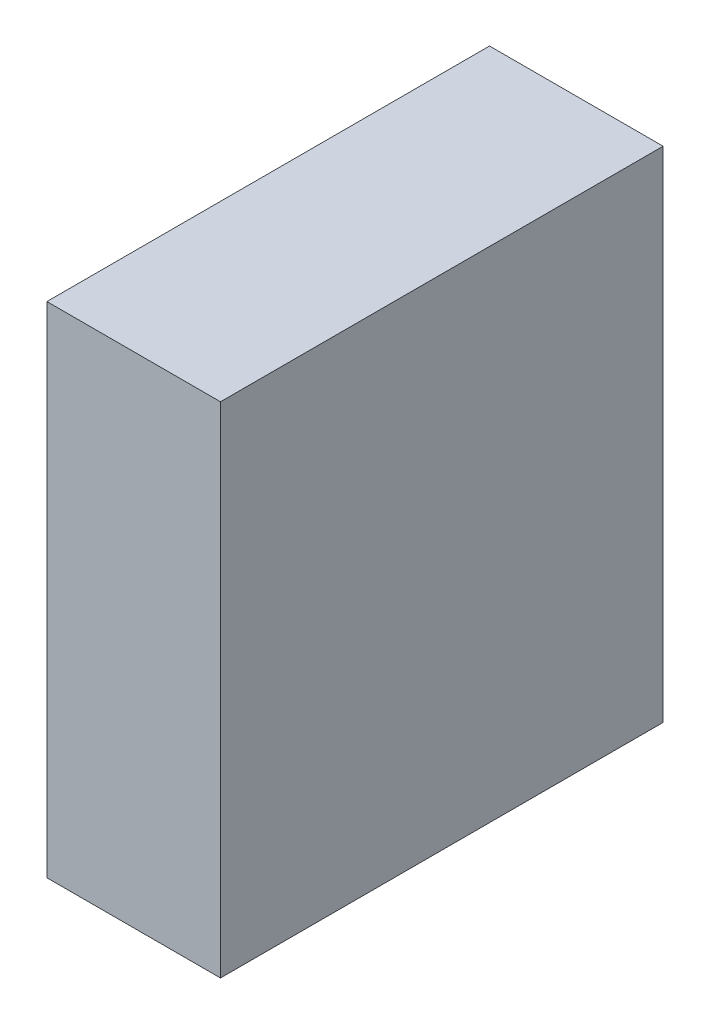
ISO-10303-21;
HEADER;
FILE_DESCRIPTION(('STEP AP214'),'2;1');
FILE_NAME('part.step','',(''),(''),'','','');
FILE_SCHEMA(('AUTOMOTIVE_DESIGN { 1 0 10303 214 1 1 1 1 }'));
ENDSEC;
DATA;
#1=APPLICATION_CONTEXT('core data for automotive mechanical design processes');
#2=APPLICATION_PROTOCOL_DEFINITION('international standard','automotive_design',2000,#1);
#3=PRODUCT_CONTEXT('',#1,'mechanical');
#4=PRODUCT('Part','Part','',(#3));
#5=PRODUCT_RELATED_PRODUCT_CATEGORY('part','',(#4));
#6=PRODUCT_DEFINITION_FORMATION('','',#4);
#7=PRODUCT_DEFINITION_CONTEXT('part definition',#1,'design');
#8=PRODUCT_DEFINITION('design','',#6,#7);
#9=PRODUCT_DEFINITION_SHAPE('','',#8);
#10=(LENGTH_UNIT() NAMED_UNIT(*) SI_UNIT(.MILLI.,.METRE.));
#11=(NAMED_UNIT(*) PLANE_ANGLE_UNIT() SI_UNIT($,.RADIAN.));
#12=(NAMED_UNIT(*) SI_UNIT($,.STERADIAN.) SOLID_ANGLE_UNIT());
#13=UNCERTAINTY_MEASURE_WITH_UNIT(LENGTH_MEASURE(1.E-05),#10,'distance_accuracy_value','');
#14=(GEOMETRIC_REPRESENTATION_CONTEXT(3) GLOBAL_UNCERTAINTY_ASSIGNED_CONTEXT((#13)) GLOBAL_UNIT_ASSIGNED_CONTEXT((#10,
#11,#12)) REPRESENTATION_CONTEXT('',''));
#15=CARTESIAN_POINT('',(0.,0.,0.));
#16=DIRECTION('',(0.,0.,1.));
#17=DIRECTION('',(1.,0.,0.));
#18=AXIS2_PLACEMENT_3D('',#15,#16,#17);
#19=CARTESIAN_POINT('',(0.0999998,0.28750006,0.));
#20=DIRECTION('',(1.,0.,0.));
#21=DIRECTION('',(0.,0.,-1.));
#22=AXIS2_PLACEMENT_3D('',#19,#20,#21);
#23=PLANE('',#22);
#24=DIRECTION('',(0.,0.,-1.));
#25=VECTOR('',#24,1.);
#26=CARTESIAN_POINT('',(0.0999998,-0.2875026,0.));
#27=LINE('',#26,#25);
#28=CARTESIAN_POINT('',(0.0999998,-0.2875026,0.));
#29=VERTEX_POINT('',#28);
#30=CARTESIAN_POINT('',(0.0999998,-0.2875026,0.50999898));
#31=VERTEX_POINT('',#30);
#32=EDGE_CURVE('E20',#29,#31,#27,.F.);
#33=ORIENTED_EDGE('',*,*,#32,.F.);
#34=DIRECTION('',(0.,1.,0.));
#35=VECTOR('',#34,1.);
#36=CARTESIAN_POINT('',(0.0999998,-0.2875026,0.));
#37=LINE('',#36,#35);
#38=CARTESIAN_POINT('',(0.0999998,0.28750006,0.));
#39=VERTEX_POINT('',#38);
#40=EDGE_CURVE('E80',#29,#39,#37,.T.);
#41=ORIENTED_EDGE('',*,*,#40,.T.);
#42=DIRECTION('',(0.,0.,1.));
#43=VECTOR('',#42,1.);
#44=CARTESIAN_POINT('',(0.0999998,0.28750006,0.));
#45=LINE('',#44,#43);
#46=CARTESIAN_POINT('',(0.0999998,0.28750006,0.50999898));
#47=VERTEX_POINT('',#46);
#48=EDGE_CURVE('E68',#47,#39,#45,.F.);
#49=ORIENTED_EDGE('',*,*,#48,.F.);
#50=DIRECTION('',(0.,1.,0.));
#51=VECTOR('',#50,1.);
#52=CARTESIAN_POINT('',(0.0999998,-0.2875026,0.50999898));
#53=LINE('',#52,#51);
#54=EDGE_CURVE('E56',#31,#47,#53,.T.);
#55=ORIENTED_EDGE('',*,*,#54,.F.);
#56=EDGE_LOOP('',(#33,#41,#49,#55));
#57=FACE_BOUND('',#56,.T.);
#58=ADVANCED_FACE('F17',(#57),#23,.T.);
#59=CARTESIAN_POINT('',(0.0999998,-0.2875026,0.));
#60=DIRECTION('',(0.,-1.,0.));
#61=DIRECTION('',(0.,0.,-1.));
#62=AXIS2_PLACEMENT_3D('',#59,#60,#61);
#63=PLANE('',#62);
#64=DIRECTION('',(0.,0.,1.));
#65=VECTOR('',#64,1.);
#66=CARTESIAN_POINT('',(-0.0999998,-0.2875026,0.));
#67=LINE('',#66,#65);
#68=CARTESIAN_POINT('',(-0.0999998,-0.2875026,0.));
#69=VERTEX_POINT('',#68);
#70=CARTESIAN_POINT('',(-0.0999998,-0.2875026,0.50999898));
#71=VERTEX_POINT('',#70);
#72=EDGE_CURVE('E83',#69,#71,#67,.T.);
#73=ORIENTED_EDGE('',*,*,#72,.F.);
#74=DIRECTION('',(1.,0.,0.));
#75=VECTOR('',#74,1.);
#76=CARTESIAN_POINT('',(-0.0999998,-0.2875026,0.));
#77=LINE('',#76,#75);
#78=EDGE_CURVE('E65',#69,#29,#77,.T.);
#79=ORIENTED_EDGE('',*,*,#78,.T.);
#80=ORIENTED_EDGE('',*,*,#32,.T.);
#81=DIRECTION('',(1.,0.,0.));
#82=VECTOR('',#81,1.);
#83=CARTESIAN_POINT('',(-0.0999998,-0.2875026,0.50999898));
#84=LINE('',#83,#82);
#85=EDGE_CURVE('E62',#71,#31,#84,.T.);
#86=ORIENTED_EDGE('',*,*,#85,.F.);
#87=EDGE_LOOP('',(#73,#79,#80,#86));
#88=FACE_BOUND('',#87,.T.);
#89=ADVANCED_FACE('F61',(#88),#63,.T.);
#90=CARTESIAN_POINT('',(-0.0999998,-0.2875026,0.50999898));
#91=DIRECTION('',(0.,0.,1.));
#92=DIRECTION('',(1.,0.,0.));
#93=AXIS2_PLACEMENT_3D('',#90,#91,#92);
#94=PLANE('',#93);
#95=DIRECTION('',(1.,0.,0.));
#96=VECTOR('',#95,1.);
#97=CARTESIAN_POINT('',(-0.0999998,0.28750006,0.50999898));
#98=LINE('',#97,#96);
#99=CARTESIAN_POINT('',(-0.0999998,0.28750006,0.50999898));
#100=VERTEX_POINT('',#99);
#101=EDGE_CURVE('E70',#100,#47,#98,.T.);
#102=ORIENTED_EDGE('',*,*,#101,.F.);
#103=DIRECTION('',(0.,1.,0.));
#104=VECTOR('',#103,1.);
#105=CARTESIAN_POINT('',(-0.0999998,-0.2875026,0.50999898));
#106=LINE('',#105,#104);
#107=EDGE_CURVE('E74',#71,#100,#106,.T.);
#108=ORIENTED_EDGE('',*,*,#107,.F.);
#109=ORIENTED_EDGE('',*,*,#85,.T.);
#110=ORIENTED_EDGE('',*,*,#54,.T.);
#111=EDGE_LOOP('',(#102,#108,#109,#110));
#112=FACE_BOUND('',#111,.T.);
#113=ADVANCED_FACE('F72',(#112),#94,.T.);
#114=CARTESIAN_POINT('',(-0.0999998,0.28750006,0.));
#115=DIRECTION('',(0.,1.,0.));
#116=DIRECTION('',(0.,0.,1.));
#117=AXIS2_PLACEMENT_3D('',#114,#115,#116);
#118=PLANE('',#117);
#119=ORIENTED_EDGE('',*,*,#48,.T.);
#120=DIRECTION('',(1.,0.,0.));
#121=VECTOR('',#120,1.);
#122=CARTESIAN_POINT('',(-0.0999998,0.28750006,0.));
#123=LINE('',#122,#121);
#124=CARTESIAN_POINT('',(-0.0999998,0.28750006,0.));
#125=VERTEX_POINT('',#124);
#126=EDGE_CURVE('E35',#39,#125,#123,.F.);
#127=ORIENTED_EDGE('',*,*,#126,.T.);
#128=DIRECTION('',(0.,0.,1.));
#129=VECTOR('',#128,1.);
#130=CARTESIAN_POINT('',(-0.0999998,0.28750006,0.));
#131=LINE('',#130,#129);
#132=EDGE_CURVE('E26',#100,#125,#131,.F.);
#133=ORIENTED_EDGE('',*,*,#132,.F.);
#134=ORIENTED_EDGE('',*,*,#101,.T.);
#135=EDGE_LOOP('',(#119,#127,#133,#134));
#136=FACE_BOUND('',#135,.T.);
#137=ADVANCED_FACE('F89',(#136),#118,.T.);
#138=CARTESIAN_POINT('',(-0.0999998,-0.2875026,0.));
#139=DIRECTION('',(0.,0.,1.));
#140=DIRECTION('',(1.,0.,0.));
#141=AXIS2_PLACEMENT_3D('',#138,#139,#140);
#142=PLANE('',#141);
#143=ORIENTED_EDGE('',*,*,#126,.F.);
#144=ORIENTED_EDGE('',*,*,#40,.F.);
#145=ORIENTED_EDGE('',*,*,#78,.F.);
#146=DIRECTION('',(0.,1.,0.));
#147=VECTOR('',#146,1.);
#148=CARTESIAN_POINT('',(-0.0999998,-0.2875026,0.));
#149=LINE('',#148,#147);
#150=EDGE_CURVE('E11',#125,#69,#149,.F.);
#151=ORIENTED_EDGE('',*,*,#150,.F.);
#152=EDGE_LOOP('',(#143,#144,#145,#151));
#153=FACE_BOUND('',#152,.T.);
#154=ADVANCED_FACE('F91',(#153),#142,.F.);
#155=CARTESIAN_POINT('',(-0.0999998,-0.2875026,0.));
#156=DIRECTION('',(-1.,0.,0.));
#157=DIRECTION('',(0.,0.,1.));
#158=AXIS2_PLACEMENT_3D('',#155,#156,#157);
#159=PLANE('',#158);
#160=ORIENTED_EDGE('',*,*,#132,.T.);
#161=ORIENTED_EDGE('',*,*,#150,.T.);
#162=ORIENTED_EDGE('',*,*,#72,.T.);
#163=ORIENTED_EDGE('',*,*,#107,.T.);
#164=EDGE_LOOP('',(#160,#161,#162,#163));
#165=FACE_BOUND('',#164,.T.);
#166=ADVANCED_FACE('F88',(#165),#159,.T.);
#167=CLOSED_SHELL('',(#58,#89,#113,#137,#154,#166));
#168=MANIFOLD_SOLID_BREP('B1',#167);
#169=ADVANCED_BREP_SHAPE_REPRESENTATION('',(#18,#168),#14);
#170=SHAPE_DEFINITION_REPRESENTATION(#9,#169);
ENDSEC;
END-ISO-10303-21;
